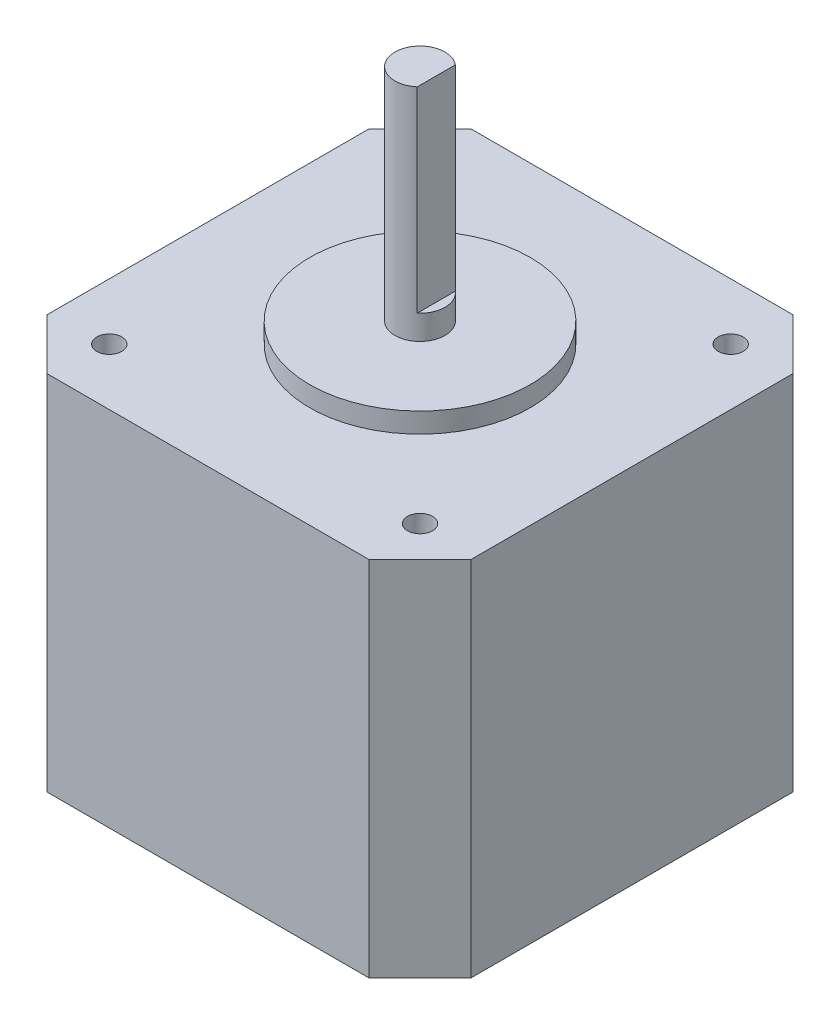
ISO-10303-21;
HEADER;
FILE_DESCRIPTION(('STEP AP214'),'2;1');
FILE_NAME('part.step','',(''),(''),'','','');
FILE_SCHEMA(('AUTOMOTIVE_DESIGN { 1 0 10303 214 1 1 1 1 }'));
ENDSEC;
DATA;
#1=APPLICATION_CONTEXT('core data for automotive mechanical design processes');
#2=APPLICATION_PROTOCOL_DEFINITION('international standard','automotive_design',2000,#1);
#3=PRODUCT_CONTEXT('',#1,'mechanical');
#4=PRODUCT('Part','Part','',(#3));
#5=PRODUCT_RELATED_PRODUCT_CATEGORY('part','',(#4));
#6=PRODUCT_DEFINITION_FORMATION('','',#4);
#7=PRODUCT_DEFINITION_CONTEXT('part definition',#1,'design');
#8=PRODUCT_DEFINITION('design','',#6,#7);
#9=PRODUCT_DEFINITION_SHAPE('','',#8);
#10=(LENGTH_UNIT() NAMED_UNIT(*) SI_UNIT(.MILLI.,.METRE.));
#11=(NAMED_UNIT(*) PLANE_ANGLE_UNIT() SI_UNIT($,.RADIAN.));
#12=(NAMED_UNIT(*) SI_UNIT($,.STERADIAN.) SOLID_ANGLE_UNIT());
#13=UNCERTAINTY_MEASURE_WITH_UNIT(LENGTH_MEASURE(1.E-05),#10,'distance_accuracy_value','');
#14=(GEOMETRIC_REPRESENTATION_CONTEXT(3) GLOBAL_UNCERTAINTY_ASSIGNED_CONTEXT((#13)) GLOBAL_UNIT_ASSIGNED_CONTEXT((#10,
#11,#12)) REPRESENTATION_CONTEXT('',''));
#15=CARTESIAN_POINT('',(0.,0.,0.));
#16=DIRECTION('',(0.,0.,1.));
#17=DIRECTION('',(1.,0.,0.));
#18=AXIS2_PLACEMENT_3D('',#15,#16,#17);
#19=CARTESIAN_POINT('',(-16.07,36.158,-21.15));
#20=DIRECTION('',(0.,0.,1.));
#21=DIRECTION('',(1.,0.,0.));
#22=AXIS2_PLACEMENT_3D('',#19,#20,#21);
#23=PLANE('',#22);
#24=DIRECTION('',(-1.,0.,0.));
#25=VECTOR('',#24,1.);
#26=CARTESIAN_POINT('',(-16.07,0.,-21.15));
#27=LINE('',#26,#25);
#28=CARTESIAN_POINT('',(16.07,0.,-21.15));
#29=VERTEX_POINT('',#28);
#30=CARTESIAN_POINT('',(-16.07,0.,-21.15));
#31=VERTEX_POINT('',#30);
#32=EDGE_CURVE('E142',#29,#31,#27,.T.);
#33=ORIENTED_EDGE('',*,*,#32,.T.);
#34=DIRECTION('',(0.,-1.,0.));
#35=VECTOR('',#34,1.);
#36=CARTESIAN_POINT('',(-16.07,36.158,-21.15));
#37=LINE('',#36,#35);
#38=CARTESIAN_POINT('',(-16.07,36.158,-21.15));
#39=VERTEX_POINT('',#38);
#40=EDGE_CURVE('E170',#39,#31,#37,.T.);
#41=ORIENTED_EDGE('',*,*,#40,.F.);
#42=DIRECTION('',(-1.,0.,0.));
#43=VECTOR('',#42,1.);
#44=CARTESIAN_POINT('',(-16.07,36.158,-21.15));
#45=LINE('',#44,#43);
#46=CARTESIAN_POINT('',(16.07,36.158,-21.15));
#47=VERTEX_POINT('',#46);
#48=EDGE_CURVE('E158',#47,#39,#45,.T.);
#49=ORIENTED_EDGE('',*,*,#48,.F.);
#50=DIRECTION('',(0.,-1.,0.));
#51=VECTOR('',#50,1.);
#52=CARTESIAN_POINT('',(16.07,36.158,-21.15));
#53=LINE('',#52,#51);
#54=EDGE_CURVE('E138',#47,#29,#53,.T.);
#55=ORIENTED_EDGE('',*,*,#54,.T.);
#56=EDGE_LOOP('',(#33,#41,#49,#55));
#57=FACE_BOUND('',#56,.T.);
#58=ADVANCED_FACE('F33',(#57),#23,.F.);
#59=CARTESIAN_POINT('',(-21.15,36.158,-16.07));
#60=DIRECTION('',(0.707106781186547,0.,0.707106781186547));
#61=DIRECTION('',(0.707106781186548,0.,-0.707106781186548));
#62=AXIS2_PLACEMENT_3D('',#59,#60,#61);
#63=PLANE('',#62);
#64=DIRECTION('',(-0.707106781186548,0.,0.707106781186548));
#65=VECTOR('',#64,1.);
#66=CARTESIAN_POINT('',(-21.15,0.,-16.07));
#67=LINE('',#66,#65);
#68=CARTESIAN_POINT('',(-21.15,0.,-16.07));
#69=VERTEX_POINT('',#68);
#70=EDGE_CURVE('E145',#31,#69,#67,.T.);
#71=ORIENTED_EDGE('',*,*,#70,.T.);
#72=DIRECTION('',(0.,-1.,0.));
#73=VECTOR('',#72,1.);
#74=CARTESIAN_POINT('',(-21.15,36.158,-16.07));
#75=LINE('',#74,#73);
#76=CARTESIAN_POINT('',(-21.15,36.158,-16.07));
#77=VERTEX_POINT('',#76);
#78=EDGE_CURVE('E168',#77,#69,#75,.T.);
#79=ORIENTED_EDGE('',*,*,#78,.F.);
#80=DIRECTION('',(-0.707106781186548,0.,0.707106781186548));
#81=VECTOR('',#80,1.);
#82=CARTESIAN_POINT('',(-21.15,36.158,-16.07));
#83=LINE('',#82,#81);
#84=EDGE_CURVE('E99',#39,#77,#83,.T.);
#85=ORIENTED_EDGE('',*,*,#84,.F.);
#86=ORIENTED_EDGE('',*,*,#40,.T.);
#87=EDGE_LOOP('',(#71,#79,#85,#86));
#88=FACE_BOUND('',#87,.T.);
#89=ADVANCED_FACE('F225',(#88),#63,.F.);
#90=CARTESIAN_POINT('',(-21.15,36.158,-16.07));
#91=DIRECTION('',(1.,0.,0.));
#92=DIRECTION('',(0.,0.,-1.));
#93=AXIS2_PLACEMENT_3D('',#90,#91,#92);
#94=PLANE('',#93);
#95=DIRECTION('',(0.,0.,1.));
#96=VECTOR('',#95,1.);
#97=CARTESIAN_POINT('',(-21.15,0.,-16.07));
#98=LINE('',#97,#96);
#99=CARTESIAN_POINT('',(-21.15,0.,16.07));
#100=VERTEX_POINT('',#99);
#101=EDGE_CURVE('E148',#69,#100,#98,.T.);
#102=ORIENTED_EDGE('',*,*,#101,.T.);
#103=DIRECTION('',(0.,-1.,0.));
#104=VECTOR('',#103,1.);
#105=CARTESIAN_POINT('',(-21.15,36.158,16.07));
#106=LINE('',#105,#104);
#107=CARTESIAN_POINT('',(-21.15,36.158,16.07));
#108=VERTEX_POINT('',#107);
#109=EDGE_CURVE('E165',#108,#100,#106,.T.);
#110=ORIENTED_EDGE('',*,*,#109,.F.);
#111=DIRECTION('',(0.,0.,1.));
#112=VECTOR('',#111,1.);
#113=CARTESIAN_POINT('',(-21.15,36.158,-16.07));
#114=LINE('',#113,#112);
#115=EDGE_CURVE('E208',#77,#108,#114,.T.);
#116=ORIENTED_EDGE('',*,*,#115,.F.);
#117=ORIENTED_EDGE('',*,*,#78,.T.);
#118=EDGE_LOOP('',(#102,#110,#116,#117));
#119=FACE_BOUND('',#118,.T.);
#120=ADVANCED_FACE('F228',(#119),#94,.F.);
#121=CARTESIAN_POINT('',(-21.15,36.158,16.07));
#122=DIRECTION('',(0.707106781186547,0.,-0.707106781186547));
#123=DIRECTION('',(-0.707106781186548,0.,-0.707106781186548));
#124=AXIS2_PLACEMENT_3D('',#121,#122,#123);
#125=PLANE('',#124);
#126=DIRECTION('',(0.707106781186548,0.,0.707106781186548));
#127=VECTOR('',#126,1.);
#128=CARTESIAN_POINT('',(-21.15,0.,16.07));
#129=LINE('',#128,#127);
#130=CARTESIAN_POINT('',(-16.07,0.,21.15));
#131=VERTEX_POINT('',#130);
#132=EDGE_CURVE('E150',#100,#131,#129,.T.);
#133=ORIENTED_EDGE('',*,*,#132,.T.);
#134=DIRECTION('',(0.,-1.,0.));
#135=VECTOR('',#134,1.);
#136=CARTESIAN_POINT('',(-16.07,36.158,21.15));
#137=LINE('',#136,#135);
#138=CARTESIAN_POINT('',(-16.07,36.158,21.15));
#139=VERTEX_POINT('',#138);
#140=EDGE_CURVE('E162',#139,#131,#137,.T.);
#141=ORIENTED_EDGE('',*,*,#140,.F.);
#142=DIRECTION('',(0.707106781186548,0.,0.707106781186548));
#143=VECTOR('',#142,1.);
#144=CARTESIAN_POINT('',(-21.15,36.158,16.07));
#145=LINE('',#144,#143);
#146=EDGE_CURVE('E210',#108,#139,#145,.T.);
#147=ORIENTED_EDGE('',*,*,#146,.F.);
#148=ORIENTED_EDGE('',*,*,#109,.T.);
#149=EDGE_LOOP('',(#133,#141,#147,#148));
#150=FACE_BOUND('',#149,.T.);
#151=ADVANCED_FACE('F216',(#150),#125,.F.);
#152=CARTESIAN_POINT('',(-16.07,36.158,21.15));
#153=DIRECTION('',(0.,0.,-1.));
#154=DIRECTION('',(-1.,0.,0.));
#155=AXIS2_PLACEMENT_3D('',#152,#153,#154);
#156=PLANE('',#155);
#157=DIRECTION('',(1.,0.,0.));
#158=VECTOR('',#157,1.);
#159=CARTESIAN_POINT('',(-16.07,0.,21.15));
#160=LINE('',#159,#158);
#161=CARTESIAN_POINT('',(16.07,0.,21.15));
#162=VERTEX_POINT('',#161);
#163=EDGE_CURVE('E152',#131,#162,#160,.T.);
#164=ORIENTED_EDGE('',*,*,#163,.T.);
#165=DIRECTION('',(0.,-1.,0.));
#166=VECTOR('',#165,1.);
#167=CARTESIAN_POINT('',(16.07,36.158,21.15));
#168=LINE('',#167,#166);
#169=CARTESIAN_POINT('',(16.07,36.158,21.15));
#170=VERTEX_POINT('',#169);
#171=EDGE_CURVE('E133',#170,#162,#168,.T.);
#172=ORIENTED_EDGE('',*,*,#171,.F.);
#173=DIRECTION('',(1.,0.,0.));
#174=VECTOR('',#173,1.);
#175=CARTESIAN_POINT('',(-16.07,36.158,21.15));
#176=LINE('',#175,#174);
#177=EDGE_CURVE('E121',#139,#170,#176,.T.);
#178=ORIENTED_EDGE('',*,*,#177,.F.);
#179=ORIENTED_EDGE('',*,*,#140,.T.);
#180=EDGE_LOOP('',(#164,#172,#178,#179));
#181=FACE_BOUND('',#180,.T.);
#182=ADVANCED_FACE('F220',(#181),#156,.F.);
#183=CARTESIAN_POINT('',(16.07,36.158,21.15));
#184=DIRECTION('',(-0.707106781186547,0.,-0.707106781186547));
#185=DIRECTION('',(-0.707106781186548,0.,0.707106781186548));
#186=AXIS2_PLACEMENT_3D('',#183,#184,#185);
#187=PLANE('',#186);
#188=DIRECTION('',(0.707106781186548,0.,-0.707106781186548));
#189=VECTOR('',#188,1.);
#190=CARTESIAN_POINT('',(16.07,0.,21.15));
#191=LINE('',#190,#189);
#192=CARTESIAN_POINT('',(21.15,0.,16.07));
#193=VERTEX_POINT('',#192);
#194=EDGE_CURVE('E130',#162,#193,#191,.T.);
#195=ORIENTED_EDGE('',*,*,#194,.T.);
#196=DIRECTION('',(0.,-1.,0.));
#197=VECTOR('',#196,1.);
#198=CARTESIAN_POINT('',(21.15,36.158,16.07));
#199=LINE('',#198,#197);
#200=CARTESIAN_POINT('',(21.15,36.158,16.07));
#201=VERTEX_POINT('',#200);
#202=EDGE_CURVE('E127',#201,#193,#199,.T.);
#203=ORIENTED_EDGE('',*,*,#202,.F.);
#204=DIRECTION('',(0.707106781186548,0.,-0.707106781186548));
#205=VECTOR('',#204,1.);
#206=CARTESIAN_POINT('',(16.07,36.158,21.15));
#207=LINE('',#206,#205);
#208=EDGE_CURVE('E114',#170,#201,#207,.T.);
#209=ORIENTED_EDGE('',*,*,#208,.F.);
#210=ORIENTED_EDGE('',*,*,#171,.T.);
#211=EDGE_LOOP('',(#195,#203,#209,#210));
#212=FACE_BOUND('',#211,.T.);
#213=ADVANCED_FACE('F128',(#212),#187,.F.);
#214=CARTESIAN_POINT('',(21.15,36.158,-16.07));
#215=DIRECTION('',(-1.,0.,0.));
#216=DIRECTION('',(0.,0.,1.));
#217=AXIS2_PLACEMENT_3D('',#214,#215,#216);
#218=PLANE('',#217);
#219=DIRECTION('',(0.,0.,-1.));
#220=VECTOR('',#219,1.);
#221=CARTESIAN_POINT('',(21.15,0.,-16.07));
#222=LINE('',#221,#220);
#223=CARTESIAN_POINT('',(21.15,0.,-16.07));
#224=VERTEX_POINT('',#223);
#225=EDGE_CURVE('E155',#193,#224,#222,.T.);
#226=ORIENTED_EDGE('',*,*,#225,.T.);
#227=DIRECTION('',(0.,-1.,0.));
#228=VECTOR('',#227,1.);
#229=CARTESIAN_POINT('',(21.15,36.158,-16.07));
#230=LINE('',#229,#228);
#231=CARTESIAN_POINT('',(21.15,36.158,-16.07));
#232=VERTEX_POINT('',#231);
#233=EDGE_CURVE('E134',#232,#224,#230,.T.);
#234=ORIENTED_EDGE('',*,*,#233,.F.);
#235=DIRECTION('',(0.,0.,-1.));
#236=VECTOR('',#235,1.);
#237=CARTESIAN_POINT('',(21.15,36.158,-16.07));
#238=LINE('',#237,#236);
#239=EDGE_CURVE('E118',#201,#232,#238,.T.);
#240=ORIENTED_EDGE('',*,*,#239,.F.);
#241=ORIENTED_EDGE('',*,*,#202,.T.);
#242=EDGE_LOOP('',(#226,#234,#240,#241));
#243=FACE_BOUND('',#242,.T.);
#244=ADVANCED_FACE('F136',(#243),#218,.F.);
#245=CARTESIAN_POINT('',(16.07,36.158,-21.15));
#246=DIRECTION('',(-0.707106781186547,0.,0.707106781186547));
#247=DIRECTION('',(0.707106781186548,0.,0.707106781186548));
#248=AXIS2_PLACEMENT_3D('',#245,#246,#247);
#249=PLANE('',#248);
#250=DIRECTION('',(-0.707106781186548,0.,-0.707106781186548));
#251=VECTOR('',#250,1.);
#252=CARTESIAN_POINT('',(16.07,0.,-21.15));
#253=LINE('',#252,#251);
#254=EDGE_CURVE('E90',#224,#29,#253,.T.);
#255=ORIENTED_EDGE('',*,*,#254,.T.);
#256=ORIENTED_EDGE('',*,*,#54,.F.);
#257=DIRECTION('',(-0.707106781186548,0.,-0.707106781186548));
#258=VECTOR('',#257,1.);
#259=CARTESIAN_POINT('',(16.07,36.158,-21.15));
#260=LINE('',#259,#258);
#261=EDGE_CURVE('E57',#232,#47,#260,.T.);
#262=ORIENTED_EDGE('',*,*,#261,.F.);
#263=ORIENTED_EDGE('',*,*,#233,.T.);
#264=EDGE_LOOP('',(#255,#256,#262,#263));
#265=FACE_BOUND('',#264,.T.);
#266=ADVANCED_FACE('F180',(#265),#249,.F.);
#267=CARTESIAN_POINT('',(0.,36.158,0.));
#268=DIRECTION('',(0.,-1.,0.));
#269=DIRECTION('',(0.,0.,-1.));
#270=AXIS2_PLACEMENT_3D('',#267,#268,#269);
#271=PLANE('',#270);
#272=CARTESIAN_POINT('',(0.,36.158,0.));
#273=DIRECTION('',(0.,-1.,0.));
#274=DIRECTION('',(0.,0.,-1.));
#275=AXIS2_PLACEMENT_3D('',#272,#273,#274);
#276=CIRCLE('',#275,11.);
#277=CARTESIAN_POINT('',(0.,36.158,-11.));
#278=VERTEX_POINT('',#277);
#279=EDGE_CURVE('E36',#278,#278,#276,.F.);
#280=ORIENTED_EDGE('',*,*,#279,.F.);
#281=EDGE_LOOP('',(#280));
#282=FACE_BOUND('',#281,.T.);
#283=CARTESIAN_POINT('',(-15.5,36.158,-15.5000000000001));
#284=DIRECTION('',(0.,1.,0.));
#285=DIRECTION('',(0.,0.,1.));
#286=AXIS2_PLACEMENT_3D('',#283,#284,#285);
#287=CIRCLE('',#286,1.24999999999999);
#288=CARTESIAN_POINT('',(-15.5,36.158,-14.2500000000001));
#289=VERTEX_POINT('',#288);
#290=EDGE_CURVE('E185',#289,#289,#287,.T.);
#291=ORIENTED_EDGE('',*,*,#290,.F.);
#292=EDGE_LOOP('',(#291));
#293=FACE_BOUND('',#292,.T.);
#294=CARTESIAN_POINT('',(15.5,36.158,-15.5000000000001));
#295=DIRECTION('',(0.,1.,0.));
#296=DIRECTION('',(0.,0.,1.));
#297=AXIS2_PLACEMENT_3D('',#294,#295,#296);
#298=CIRCLE('',#297,1.24999999999999);
#299=CARTESIAN_POINT('',(15.5,36.158,-14.2500000000001));
#300=VERTEX_POINT('',#299);
#301=EDGE_CURVE('E189',#300,#300,#298,.T.);
#302=ORIENTED_EDGE('',*,*,#301,.F.);
#303=EDGE_LOOP('',(#302));
#304=FACE_BOUND('',#303,.T.);
#305=CARTESIAN_POINT('',(15.5,36.158,15.5000000000001));
#306=DIRECTION('',(0.,1.,0.));
#307=DIRECTION('',(0.,0.,1.));
#308=AXIS2_PLACEMENT_3D('',#305,#306,#307);
#309=CIRCLE('',#308,1.24999999999999);
#310=CARTESIAN_POINT('',(15.5,36.158,16.7500000000001));
#311=VERTEX_POINT('',#310);
#312=EDGE_CURVE('E193',#311,#311,#309,.T.);
#313=ORIENTED_EDGE('',*,*,#312,.F.);
#314=EDGE_LOOP('',(#313));
#315=FACE_BOUND('',#314,.T.);
#316=CARTESIAN_POINT('',(-15.5,36.158,15.5000000000001));
#317=DIRECTION('',(0.,1.,0.));
#318=DIRECTION('',(0.,0.,1.));
#319=AXIS2_PLACEMENT_3D('',#316,#317,#318);
#320=CIRCLE('',#319,1.24999999999999);
#321=CARTESIAN_POINT('',(-15.5,36.158,16.7500000000001));
#322=VERTEX_POINT('',#321);
#323=EDGE_CURVE('E196',#322,#322,#320,.T.);
#324=ORIENTED_EDGE('',*,*,#323,.F.);
#325=EDGE_LOOP('',(#324));
#326=FACE_BOUND('',#325,.T.);
#327=ORIENTED_EDGE('',*,*,#48,.T.);
#328=ORIENTED_EDGE('',*,*,#84,.T.);
#329=ORIENTED_EDGE('',*,*,#115,.T.);
#330=ORIENTED_EDGE('',*,*,#146,.T.);
#331=ORIENTED_EDGE('',*,*,#177,.T.);
#332=ORIENTED_EDGE('',*,*,#208,.T.);
#333=ORIENTED_EDGE('',*,*,#239,.T.);
#334=ORIENTED_EDGE('',*,*,#261,.T.);
#335=EDGE_LOOP('',(#327,#328,#329,#330,#331,#332,#333,#334));
#336=FACE_BOUND('',#335,.T.);
#337=ADVANCED_FACE('F116',(#282,#293,#304,#315,#326,#336),#271,.F.);
#338=CARTESIAN_POINT('',(0.,0.,0.));
#339=DIRECTION('',(0.,-1.,0.));
#340=DIRECTION('',(0.,0.,-1.));
#341=AXIS2_PLACEMENT_3D('',#338,#339,#340);
#342=PLANE('',#341);
#343=ORIENTED_EDGE('',*,*,#32,.F.);
#344=ORIENTED_EDGE('',*,*,#254,.F.);
#345=ORIENTED_EDGE('',*,*,#225,.F.);
#346=ORIENTED_EDGE('',*,*,#194,.F.);
#347=ORIENTED_EDGE('',*,*,#163,.F.);
#348=ORIENTED_EDGE('',*,*,#132,.F.);
#349=ORIENTED_EDGE('',*,*,#101,.F.);
#350=ORIENTED_EDGE('',*,*,#70,.F.);
#351=EDGE_LOOP('',(#343,#344,#345,#346,#347,#348,#349,#350));
#352=FACE_BOUND('',#351,.T.);
#353=ADVANCED_FACE('F179',(#352),#342,.T.);
#354=CARTESIAN_POINT('',(-15.5,23.458,15.5000000000001));
#355=DIRECTION('',(0.,1.,0.));
#356=DIRECTION('',(0.,0.,1.));
#357=AXIS2_PLACEMENT_3D('',#354,#355,#356);
#358=CONICAL_SURFACE('',#357,1.25,1.02974425867665);
#359=CARTESIAN_POINT('',(-15.5,22.7069242262156,15.5000000000001));
#360=VERTEX_POINT('',#359);
#361=VERTEX_LOOP('',#360);
#362=FACE_BOUND('',#361,.T.);
#363=CARTESIAN_POINT('',(-15.5,23.458,15.5000000000001));
#364=DIRECTION('',(0.,1.,0.));
#365=DIRECTION('',(0.,0.,1.));
#366=AXIS2_PLACEMENT_3D('',#363,#364,#365);
#367=CIRCLE('',#366,1.25);
#368=CARTESIAN_POINT('',(-15.5,23.458,16.7500000000001));
#369=VERTEX_POINT('',#368);
#370=EDGE_CURVE('E146',#369,#369,#367,.T.);
#371=ORIENTED_EDGE('',*,*,#370,.T.);
#372=EDGE_LOOP('',(#371));
#373=FACE_BOUND('',#372,.T.);
#374=ADVANCED_FACE('F295',(#362,#373),#358,.F.);
#375=CARTESIAN_POINT('',(-15.5,36.158,15.5000000000001));
#376=DIRECTION('',(0.,1.,0.));
#377=DIRECTION('',(0.,0.,1.));
#378=AXIS2_PLACEMENT_3D('',#375,#376,#377);
#379=CYLINDRICAL_SURFACE('',#378,1.24999999999999);
#380=ORIENTED_EDGE('',*,*,#370,.F.);
#381=EDGE_LOOP('',(#380));
#382=FACE_BOUND('',#381,.T.);
#383=ORIENTED_EDGE('',*,*,#323,.T.);
#384=EDGE_LOOP('',(#383));
#385=FACE_BOUND('',#384,.T.);
#386=ADVANCED_FACE('F304',(#382,#385),#379,.F.);
#387=CARTESIAN_POINT('',(15.5,23.458,15.5000000000001));
#388=DIRECTION('',(0.,1.,0.));
#389=DIRECTION('',(0.,0.,1.));
#390=AXIS2_PLACEMENT_3D('',#387,#388,#389);
#391=CONICAL_SURFACE('',#390,1.25,1.02974425867665);
#392=CARTESIAN_POINT('',(15.5,22.7069242262156,15.5000000000001));
#393=VERTEX_POINT('',#392);
#394=VERTEX_LOOP('',#393);
#395=FACE_BOUND('',#394,.T.);
#396=CARTESIAN_POINT('',(15.5,23.458,15.5000000000001));
#397=DIRECTION('',(0.,1.,0.));
#398=DIRECTION('',(0.,0.,1.));
#399=AXIS2_PLACEMENT_3D('',#396,#397,#398);
#400=CIRCLE('',#399,1.25);
#401=CARTESIAN_POINT('',(15.5,23.458,16.7500000000001));
#402=VERTEX_POINT('',#401);
#403=EDGE_CURVE('E198',#402,#402,#400,.T.);
#404=ORIENTED_EDGE('',*,*,#403,.T.);
#405=EDGE_LOOP('',(#404));
#406=FACE_BOUND('',#405,.T.);
#407=ADVANCED_FACE('F314',(#395,#406),#391,.F.);
#408=CARTESIAN_POINT('',(15.5,36.158,15.5000000000001));
#409=DIRECTION('',(0.,1.,0.));
#410=DIRECTION('',(0.,0.,1.));
#411=AXIS2_PLACEMENT_3D('',#408,#409,#410);
#412=CYLINDRICAL_SURFACE('',#411,1.24999999999999);
#413=ORIENTED_EDGE('',*,*,#403,.F.);
#414=EDGE_LOOP('',(#413));
#415=FACE_BOUND('',#414,.T.);
#416=ORIENTED_EDGE('',*,*,#312,.T.);
#417=EDGE_LOOP('',(#416));
#418=FACE_BOUND('',#417,.T.);
#419=ADVANCED_FACE('F324',(#415,#418),#412,.F.);
#420=CARTESIAN_POINT('',(15.5,23.458,-15.5000000000001));
#421=DIRECTION('',(0.,1.,0.));
#422=DIRECTION('',(0.,0.,1.));
#423=AXIS2_PLACEMENT_3D('',#420,#421,#422);
#424=CONICAL_SURFACE('',#423,1.25,1.02974425867665);
#425=CARTESIAN_POINT('',(15.5,22.7069242262156,-15.5000000000001));
#426=VERTEX_POINT('',#425);
#427=VERTEX_LOOP('',#426);
#428=FACE_BOUND('',#427,.T.);
#429=CARTESIAN_POINT('',(15.5,23.458,-15.5000000000001));
#430=DIRECTION('',(0.,1.,0.));
#431=DIRECTION('',(0.,0.,1.));
#432=AXIS2_PLACEMENT_3D('',#429,#430,#431);
#433=CIRCLE('',#432,1.25);
#434=CARTESIAN_POINT('',(15.5,23.458,-14.2500000000001));
#435=VERTEX_POINT('',#434);
#436=EDGE_CURVE('E473',#435,#435,#433,.T.);
#437=ORIENTED_EDGE('',*,*,#436,.T.);
#438=EDGE_LOOP('',(#437));
#439=FACE_BOUND('',#438,.T.);
#440=ADVANCED_FACE('F334',(#428,#439),#424,.F.);
#441=CARTESIAN_POINT('',(15.5,36.158,-15.5000000000001));
#442=DIRECTION('',(0.,1.,0.));
#443=DIRECTION('',(0.,0.,1.));
#444=AXIS2_PLACEMENT_3D('',#441,#442,#443);
#445=CYLINDRICAL_SURFACE('',#444,1.24999999999999);
#446=ORIENTED_EDGE('',*,*,#436,.F.);
#447=EDGE_LOOP('',(#446));
#448=FACE_BOUND('',#447,.T.);
#449=ORIENTED_EDGE('',*,*,#301,.T.);
#450=EDGE_LOOP('',(#449));
#451=FACE_BOUND('',#450,.T.);
#452=ADVANCED_FACE('F344',(#448,#451),#445,.F.);
#453=CARTESIAN_POINT('',(-15.5,23.458,-15.5000000000001));
#454=DIRECTION('',(0.,1.,0.));
#455=DIRECTION('',(0.,0.,1.));
#456=AXIS2_PLACEMENT_3D('',#453,#454,#455);
#457=CONICAL_SURFACE('',#456,1.25,1.02974425867665);
#458=CARTESIAN_POINT('',(-15.5,22.7069242262156,-15.5000000000001));
#459=VERTEX_POINT('',#458);
#460=VERTEX_LOOP('',#459);
#461=FACE_BOUND('',#460,.T.);
#462=CARTESIAN_POINT('',(-15.5,23.458,-15.5000000000001));
#463=DIRECTION('',(0.,1.,0.));
#464=DIRECTION('',(0.,0.,1.));
#465=AXIS2_PLACEMENT_3D('',#462,#463,#464);
#466=CIRCLE('',#465,1.25);
#467=CARTESIAN_POINT('',(-15.5,23.458,-14.2500000000001));
#468=VERTEX_POINT('',#467);
#469=EDGE_CURVE('E469',#468,#468,#466,.T.);
#470=ORIENTED_EDGE('',*,*,#469,.T.);
#471=EDGE_LOOP('',(#470));
#472=FACE_BOUND('',#471,.T.);
#473=ADVANCED_FACE('F354',(#461,#472),#457,.F.);
#474=CARTESIAN_POINT('',(-15.5,36.158,-15.5000000000001));
#475=DIRECTION('',(0.,1.,0.));
#476=DIRECTION('',(0.,0.,1.));
#477=AXIS2_PLACEMENT_3D('',#474,#475,#476);
#478=CYLINDRICAL_SURFACE('',#477,1.24999999999999);
#479=ORIENTED_EDGE('',*,*,#469,.F.);
#480=EDGE_LOOP('',(#479));
#481=FACE_BOUND('',#480,.T.);
#482=ORIENTED_EDGE('',*,*,#290,.T.);
#483=EDGE_LOOP('',(#482));
#484=FACE_BOUND('',#483,.T.);
#485=ADVANCED_FACE('F364',(#481,#484),#478,.F.);
#486=CARTESIAN_POINT('',(0.,38.158,0.));
#487=DIRECTION('',(0.,-1.,0.));
#488=DIRECTION('',(0.,0.,-1.));
#489=AXIS2_PLACEMENT_3D('',#486,#487,#488);
#490=CYLINDRICAL_SURFACE('',#489,11.);
#491=CARTESIAN_POINT('',(0.,38.158,0.));
#492=DIRECTION('',(0.,1.,0.));
#493=DIRECTION('',(0.,0.,1.));
#494=AXIS2_PLACEMENT_3D('',#491,#492,#493);
#495=CIRCLE('',#494,11.);
#496=CARTESIAN_POINT('',(0.,38.158,11.));
#497=VERTEX_POINT('',#496);
#498=EDGE_CURVE('E464',#497,#497,#495,.T.);
#499=ORIENTED_EDGE('',*,*,#498,.F.);
#500=EDGE_LOOP('',(#499));
#501=FACE_BOUND('',#500,.T.);
#502=ORIENTED_EDGE('',*,*,#279,.T.);
#503=EDGE_LOOP('',(#502));
#504=FACE_BOUND('',#503,.T.);
#505=ADVANCED_FACE('F175',(#501,#504),#490,.T.);
#506=CARTESIAN_POINT('',(0.,38.158,0.));
#507=DIRECTION('',(0.,1.,0.));
#508=DIRECTION('',(0.,0.,1.));
#509=AXIS2_PLACEMENT_3D('',#506,#507,#508);
#510=PLANE('',#509);
#511=CARTESIAN_POINT('',(0.,38.158,0.));
#512=DIRECTION('',(0.,1.,0.));
#513=DIRECTION('',(0.,0.,1.));
#514=AXIS2_PLACEMENT_3D('',#511,#512,#513);
#515=CIRCLE('',#514,2.5);
#516=CARTESIAN_POINT('',(0.,38.158,2.5));
#517=VERTEX_POINT('',#516);
#518=EDGE_CURVE('E11',#517,#517,#515,.T.);
#519=ORIENTED_EDGE('',*,*,#518,.F.);
#520=EDGE_LOOP('',(#519));
#521=FACE_BOUND('',#520,.T.);
#522=ORIENTED_EDGE('',*,*,#498,.T.);
#523=EDGE_LOOP('',(#522));
#524=FACE_BOUND('',#523,.T.);
#525=ADVANCED_FACE('F388',(#521,#524),#510,.T.);
#526=CARTESIAN_POINT('',(0.,60.158,0.));
#527=DIRECTION('',(0.,-1.,0.));
#528=DIRECTION('',(0.,0.,-1.));
#529=AXIS2_PLACEMENT_3D('',#526,#527,#528);
#530=CYLINDRICAL_SURFACE('',#529,2.5);
#531=CARTESIAN_POINT('',(0.,60.158,0.));
#532=DIRECTION('',(0.,1.,0.));
#533=DIRECTION('',(0.,0.,1.));
#534=AXIS2_PLACEMENT_3D('',#531,#532,#533);
#535=CIRCLE('',#534,2.5);
#536=CARTESIAN_POINT('',(1.62337389588885,60.158,-1.9012251823881));
#537=VERTEX_POINT('',#536);
#538=CARTESIAN_POINT('',(1.62337389588885,60.158,1.9012251823881));
#539=VERTEX_POINT('',#538);
#540=EDGE_CURVE('E459',#537,#539,#535,.T.);
#541=ORIENTED_EDGE('',*,*,#540,.F.);
#542=DIRECTION('',(0.,1.,0.));
#543=VECTOR('',#542,1.);
#544=CARTESIAN_POINT('',(1.62337389588885,40.6,-1.9012251823881));
#545=LINE('',#544,#543);
#546=CARTESIAN_POINT('',(1.62337389588885,40.6,-1.9012251823881));
#547=VERTEX_POINT('',#546);
#548=EDGE_CURVE('E48',#547,#537,#545,.T.);
#549=ORIENTED_EDGE('',*,*,#548,.F.);
#550=CARTESIAN_POINT('',(0.,40.6,0.));
#551=DIRECTION('',(0.,1.,0.));
#552=DIRECTION('',(0.,0.,1.));
#553=AXIS2_PLACEMENT_3D('',#550,#551,#552);
#554=CIRCLE('',#553,2.5);
#555=CARTESIAN_POINT('',(1.62337389588885,40.6,1.9012251823881));
#556=VERTEX_POINT('',#555);
#557=EDGE_CURVE('E445',#556,#547,#554,.T.);
#558=ORIENTED_EDGE('',*,*,#557,.F.);
#559=DIRECTION('',(0.,1.,0.));
#560=VECTOR('',#559,1.);
#561=CARTESIAN_POINT('',(1.62337389588885,40.6,1.9012251823881));
#562=LINE('',#561,#560);
#563=EDGE_CURVE('E454',#556,#539,#562,.T.);
#564=ORIENTED_EDGE('',*,*,#563,.T.);
#565=EDGE_LOOP('',(#541,#549,#558,#564));
#566=FACE_BOUND('',#565,.T.);
#567=ORIENTED_EDGE('',*,*,#518,.T.);
#568=EDGE_LOOP('',(#567));
#569=FACE_BOUND('',#568,.T.);
#570=ADVANCED_FACE('F398',(#566,#569),#530,.T.);
#571=CARTESIAN_POINT('',(0.,60.158,0.));
#572=DIRECTION('',(0.,1.,0.));
#573=DIRECTION('',(0.,0.,1.));
#574=AXIS2_PLACEMENT_3D('',#571,#572,#573);
#575=PLANE('',#574);
#576=DIRECTION('',(0.,0.,1.));
#577=VECTOR('',#576,1.);
#578=CARTESIAN_POINT('',(1.62337389588885,60.158,-1.9012251823881));
#579=LINE('',#578,#577);
#580=EDGE_CURVE('E451',#537,#539,#579,.T.);
#581=ORIENTED_EDGE('',*,*,#580,.F.);
#582=ORIENTED_EDGE('',*,*,#540,.T.);
#583=EDGE_LOOP('',(#581,#582));
#584=FACE_BOUND('',#583,.T.);
#585=ADVANCED_FACE('F408',(#584),#575,.T.);
#586=CARTESIAN_POINT('',(1.62337389588885,40.6,-1.9012251823881));
#587=DIRECTION('',(-1.,0.,0.));
#588=DIRECTION('',(0.,0.,1.));
#589=AXIS2_PLACEMENT_3D('',#586,#587,#588);
#590=PLANE('',#589);
#591=ORIENTED_EDGE('',*,*,#580,.T.);
#592=ORIENTED_EDGE('',*,*,#563,.F.);
#593=DIRECTION('',(0.,0.,1.));
#594=VECTOR('',#593,1.);
#595=CARTESIAN_POINT('',(1.62337389588885,40.6,-1.9012251823881));
#596=LINE('',#595,#594);
#597=EDGE_CURVE('E447',#547,#556,#596,.T.);
#598=ORIENTED_EDGE('',*,*,#597,.F.);
#599=ORIENTED_EDGE('',*,*,#548,.T.);
#600=EDGE_LOOP('',(#591,#592,#598,#599));
#601=FACE_BOUND('',#600,.T.);
#602=ADVANCED_FACE('F418',(#601),#590,.F.);
#603=CARTESIAN_POINT('',(0.,40.6,0.));
#604=DIRECTION('',(0.,1.,0.));
#605=DIRECTION('',(0.,0.,1.));
#606=AXIS2_PLACEMENT_3D('',#603,#604,#605);
#607=PLANE('',#606);
#608=ORIENTED_EDGE('',*,*,#557,.T.);
#609=ORIENTED_EDGE('',*,*,#597,.T.);
#610=EDGE_LOOP('',(#608,#609));
#611=FACE_BOUND('',#610,.T.);
#612=ADVANCED_FACE('F428',(#611),#607,.T.);
#613=CLOSED_SHELL('',(#58,#89,#120,#151,#182,#213,#244,#266,#337,#353,#374,#386,#407,#419,#440,
#452,#473,#485,#505,#525,#570,#585,#602,#612));
#614=MANIFOLD_SOLID_BREP('B2',#613);
#615=ADVANCED_BREP_SHAPE_REPRESENTATION('',(#18,#614),#14);
#616=SHAPE_DEFINITION_REPRESENTATION(#9,#615);
ENDSEC;
END-ISO-10303-21;
